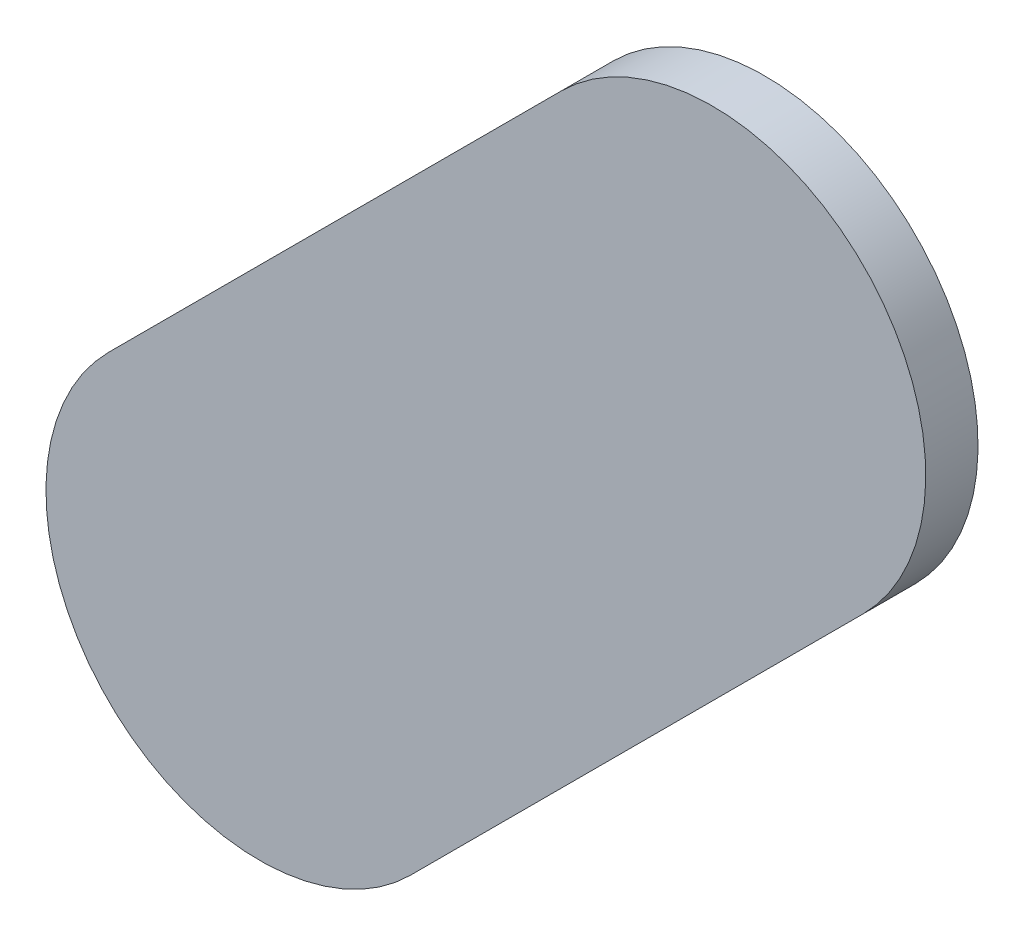
ISO-10303-21;
HEADER;
FILE_DESCRIPTION(('STEP AP214'),'2;1');
FILE_NAME('part.step','',(''),(''),'','','');
FILE_SCHEMA(('AUTOMOTIVE_DESIGN { 1 0 10303 214 1 1 1 1 }'));
ENDSEC;
DATA;
#1=APPLICATION_CONTEXT('core data for automotive mechanical design processes');
#2=APPLICATION_PROTOCOL_DEFINITION('international standard','automotive_design',2000,#1);
#3=PRODUCT_CONTEXT('',#1,'mechanical');
#4=PRODUCT('Part','Part','',(#3));
#5=PRODUCT_RELATED_PRODUCT_CATEGORY('part','',(#4));
#6=PRODUCT_DEFINITION_FORMATION('','',#4);
#7=PRODUCT_DEFINITION_CONTEXT('part definition',#1,'design');
#8=PRODUCT_DEFINITION('design','',#6,#7);
#9=PRODUCT_DEFINITION_SHAPE('','',#8);
#10=(LENGTH_UNIT() NAMED_UNIT(*) SI_UNIT(.MILLI.,.METRE.));
#11=(NAMED_UNIT(*) PLANE_ANGLE_UNIT() SI_UNIT($,.RADIAN.));
#12=(NAMED_UNIT(*) SI_UNIT($,.STERADIAN.) SOLID_ANGLE_UNIT());
#13=UNCERTAINTY_MEASURE_WITH_UNIT(LENGTH_MEASURE(1.E-05),#10,'distance_accuracy_value','');
#14=(GEOMETRIC_REPRESENTATION_CONTEXT(3) GLOBAL_UNCERTAINTY_ASSIGNED_CONTEXT((#13)) GLOBAL_UNIT_ASSIGNED_CONTEXT((#10,
#11,#12)) REPRESENTATION_CONTEXT('',''));
#15=CARTESIAN_POINT('',(0.,0.,0.));
#16=DIRECTION('',(0.,0.,1.));
#17=DIRECTION('',(1.,0.,0.));
#18=AXIS2_PLACEMENT_3D('',#15,#16,#17);
#19=CARTESIAN_POINT('',(4.07958875598,2.798927978031,0.79916));
#20=DIRECTION('',(0.,0.,1.));
#21=DIRECTION('',(1.,0.,0.));
#22=AXIS2_PLACEMENT_3D('',#19,#20,#21);
#23=PLANE('',#22);
#24=CARTESIAN_POINT('',(3.931096,2.650435333,0.79916));
#25=DIRECTION('',(0.,0.,1.));
#26=DIRECTION('',(1.,0.,0.));
#27=AXIS2_PLACEMENT_3D('',#24,#25,#26);
#28=CIRCLE('',#27,0.139999667);
#29=CARTESIAN_POINT('',(4.03009131612215,2.55144065012204,0.79916));
#30=VERTEX_POINT('',#29);
#31=CARTESIAN_POINT('',(3.83210140516727,2.74943016596486,0.79916));
#32=VERTEX_POINT('',#31);
#33=EDGE_CURVE('E20',#30,#32,#28,.F.);
#34=ORIENTED_EDGE('',*,*,#33,.F.);
#35=DIRECTION('',(-0.707106660628037,-0.707106901745037,0.));
#36=VECTOR('',#35,1.);
#37=CARTESIAN_POINT('',(4.327075948866,2.848425384135,0.79916));
#38=LINE('',#37,#36);
#39=CARTESIAN_POINT('',(4.32707612405482,2.84842555932388,0.79916));
#40=VERTEX_POINT('',#39);
#41=EDGE_CURVE('E65',#30,#40,#38,.F.);
#42=ORIENTED_EDGE('',*,*,#41,.T.);
#43=CARTESIAN_POINT('',(4.228081,2.947420434268,0.79916));
#44=DIRECTION('',(0.,0.,1.));
#45=DIRECTION('',(1.,0.,0.));
#46=AXIS2_PLACEMENT_3D('',#43,#44,#45);
#47=CIRCLE('',#46,0.14);
#48=CARTESIAN_POINT('',(4.12908597763338,3.04641531063353,0.79916));
#49=VERTEX_POINT('',#48);
#50=EDGE_CURVE('E57',#49,#40,#47,.F.);
#51=ORIENTED_EDGE('',*,*,#50,.F.);
#52=DIRECTION('',(0.707106099992719,0.707107462379719,0.));
#53=VECTOR('',#52,1.);
#54=CARTESIAN_POINT('',(3.8321016196,2.749430380398,0.79916));
#55=LINE('',#54,#53);
#56=EDGE_CURVE('E64',#49,#32,#55,.F.);
#57=ORIENTED_EDGE('',*,*,#56,.T.);
#58=EDGE_LOOP('',(#34,#42,#51,#57));
#59=FACE_BOUND('',#58,.T.);
#60=ADVANCED_FACE('F17',(#59),#23,.T.);
#61=CARTESIAN_POINT('',(4.327075948866,2.848425384135,0.76487));
#62=DIRECTION('',(-0.707106901745037,0.707106660628037,0.));
#63=DIRECTION('',(-0.707106660628037,-0.707106901745037,0.));
#64=AXIS2_PLACEMENT_3D('',#61,#62,#63);
#65=PLANE('',#64);
#66=DIRECTION('',(0.,0.,1.));
#67=VECTOR('',#66,1.);
#68=CARTESIAN_POINT('',(4.0300913330001,2.5514406669999,0.76487));
#69=LINE('',#68,#67);
#70=CARTESIAN_POINT('',(4.03009131612214,2.55144065012203,0.76487));
#71=VERTEX_POINT('',#70);
#72=EDGE_CURVE('E68',#71,#30,#69,.T.);
#73=ORIENTED_EDGE('',*,*,#72,.F.);
#74=DIRECTION('',(-0.707106660628131,-0.707106901744944,0.));
#75=VECTOR('',#74,1.);
#76=CARTESIAN_POINT('',(4.327075948866,2.848425384135,0.76487));
#77=LINE('',#76,#75);
#78=CARTESIAN_POINT('',(4.32707612405481,2.84842555932387,0.76487));
#79=VERTEX_POINT('',#78);
#80=EDGE_CURVE('E72',#79,#71,#77,.T.);
#81=ORIENTED_EDGE('',*,*,#80,.F.);
#82=DIRECTION('',(0.,0.,1.));
#83=VECTOR('',#82,1.);
#84=CARTESIAN_POINT('',(4.327075948866,2.848425384135,0.76487));
#85=LINE('',#84,#83);
#86=EDGE_CURVE('E60',#40,#79,#85,.F.);
#87=ORIENTED_EDGE('',*,*,#86,.F.);
#88=ORIENTED_EDGE('',*,*,#41,.F.);
#89=EDGE_LOOP('',(#73,#81,#87,#88));
#90=FACE_BOUND('',#89,.T.);
#91=ADVANCED_FACE('F70',(#90),#65,.F.);
#92=CARTESIAN_POINT('',(3.931096,2.650435333,0.76487));
#93=DIRECTION('',(0.,0.,1.));
#94=DIRECTION('',(1.,0.,0.));
#95=AXIS2_PLACEMENT_3D('',#92,#93,#94);
#96=CYLINDRICAL_SURFACE('',#95,0.139999667);
#97=DIRECTION('',(0.,0.,1.));
#98=VECTOR('',#97,1.);
#99=CARTESIAN_POINT('',(3.8321016196,2.749430380398,0.76487));
#100=LINE('',#99,#98);
#101=CARTESIAN_POINT('',(3.83210140516729,2.74943016596488,0.76487));
#102=VERTEX_POINT('',#101);
#103=EDGE_CURVE('E77',#32,#102,#100,.F.);
#104=ORIENTED_EDGE('',*,*,#103,.T.);
#105=CARTESIAN_POINT('',(3.931096333,2.650435565732,0.76487));
#106=DIRECTION('',(0.,0.,1.));
#107=DIRECTION('',(1.,0.,0.));
#108=AXIS2_PLACEMENT_3D('',#105,#106,#107);
#109=CIRCLE('',#108,0.14);
#110=EDGE_CURVE('E26',#71,#102,#109,.F.);
#111=ORIENTED_EDGE('',*,*,#110,.F.);
#112=ORIENTED_EDGE('',*,*,#72,.T.);
#113=ORIENTED_EDGE('',*,*,#33,.T.);
#114=EDGE_LOOP('',(#104,#111,#112,#113));
#115=FACE_BOUND('',#114,.T.);
#116=ADVANCED_FACE('F88',(#115),#96,.T.);
#117=CARTESIAN_POINT('',(3.8321016196,2.749430380398,0.76487));
#118=DIRECTION('',(0.707107462379719,-0.707106099992719,0.));
#119=DIRECTION('',(0.707106099992719,0.707107462379719,0.));
#120=AXIS2_PLACEMENT_3D('',#117,#118,#119);
#121=PLANE('',#120);
#122=DIRECTION('',(0.,0.,1.));
#123=VECTOR('',#122,1.);
#124=CARTESIAN_POINT('',(4.1290859999999,3.0464153330001,0.76487));
#125=LINE('',#124,#123);
#126=CARTESIAN_POINT('',(4.12908597763347,3.04641531063348,0.76487));
#127=VERTEX_POINT('',#126);
#128=EDGE_CURVE('E62',#127,#49,#125,.T.);
#129=ORIENTED_EDGE('',*,*,#128,.F.);
#130=DIRECTION('',(0.707106099992945,0.707107462379493,0.));
#131=VECTOR('',#130,1.);
#132=CARTESIAN_POINT('',(3.8321016196,2.749430380398,0.76487));
#133=LINE('',#132,#131);
#134=EDGE_CURVE('E11',#102,#127,#133,.T.);
#135=ORIENTED_EDGE('',*,*,#134,.F.);
#136=ORIENTED_EDGE('',*,*,#103,.F.);
#137=ORIENTED_EDGE('',*,*,#56,.F.);
#138=EDGE_LOOP('',(#129,#135,#136,#137));
#139=FACE_BOUND('',#138,.T.);
#140=ADVANCED_FACE('F96',(#139),#121,.F.);
#141=CARTESIAN_POINT('',(4.228081,2.947420434268,0.76487));
#142=DIRECTION('',(0.,0.,1.));
#143=DIRECTION('',(1.,0.,0.));
#144=AXIS2_PLACEMENT_3D('',#141,#142,#143);
#145=CYLINDRICAL_SURFACE('',#144,0.14);
#146=CARTESIAN_POINT('',(4.228081333,2.947420667,0.76487));
#147=DIRECTION('',(0.,0.,1.));
#148=DIRECTION('',(1.,0.,0.));
#149=AXIS2_PLACEMENT_3D('',#146,#147,#148);
#150=CIRCLE('',#149,0.14);
#151=EDGE_CURVE('E35',#127,#79,#150,.F.);
#152=ORIENTED_EDGE('',*,*,#151,.F.);
#153=ORIENTED_EDGE('',*,*,#128,.T.);
#154=ORIENTED_EDGE('',*,*,#50,.T.);
#155=ORIENTED_EDGE('',*,*,#86,.T.);
#156=EDGE_LOOP('',(#152,#153,#154,#155));
#157=FACE_BOUND('',#156,.T.);
#158=ADVANCED_FACE('F58',(#157),#145,.T.);
#159=CARTESIAN_POINT('',(4.07958875598,2.798927978031,0.76487));
#160=DIRECTION('',(0.,0.,-1.));
#161=DIRECTION('',(-1.,0.,0.));
#162=AXIS2_PLACEMENT_3D('',#159,#160,#161);
#163=PLANE('',#162);
#164=ORIENTED_EDGE('',*,*,#134,.T.);
#165=ORIENTED_EDGE('',*,*,#151,.T.);
#166=ORIENTED_EDGE('',*,*,#80,.T.);
#167=ORIENTED_EDGE('',*,*,#110,.T.);
#168=EDGE_LOOP('',(#164,#165,#166,#167));
#169=FACE_BOUND('',#168,.T.);
#170=ADVANCED_FACE('F89',(#169),#163,.T.);
#171=CLOSED_SHELL('',(#60,#91,#116,#140,#158,#170));
#172=MANIFOLD_SOLID_BREP('B1',#171);
#173=ADVANCED_BREP_SHAPE_REPRESENTATION('',(#18,#172),#14);
#174=SHAPE_DEFINITION_REPRESENTATION(#9,#173);
ENDSEC;
END-ISO-10303-21;
